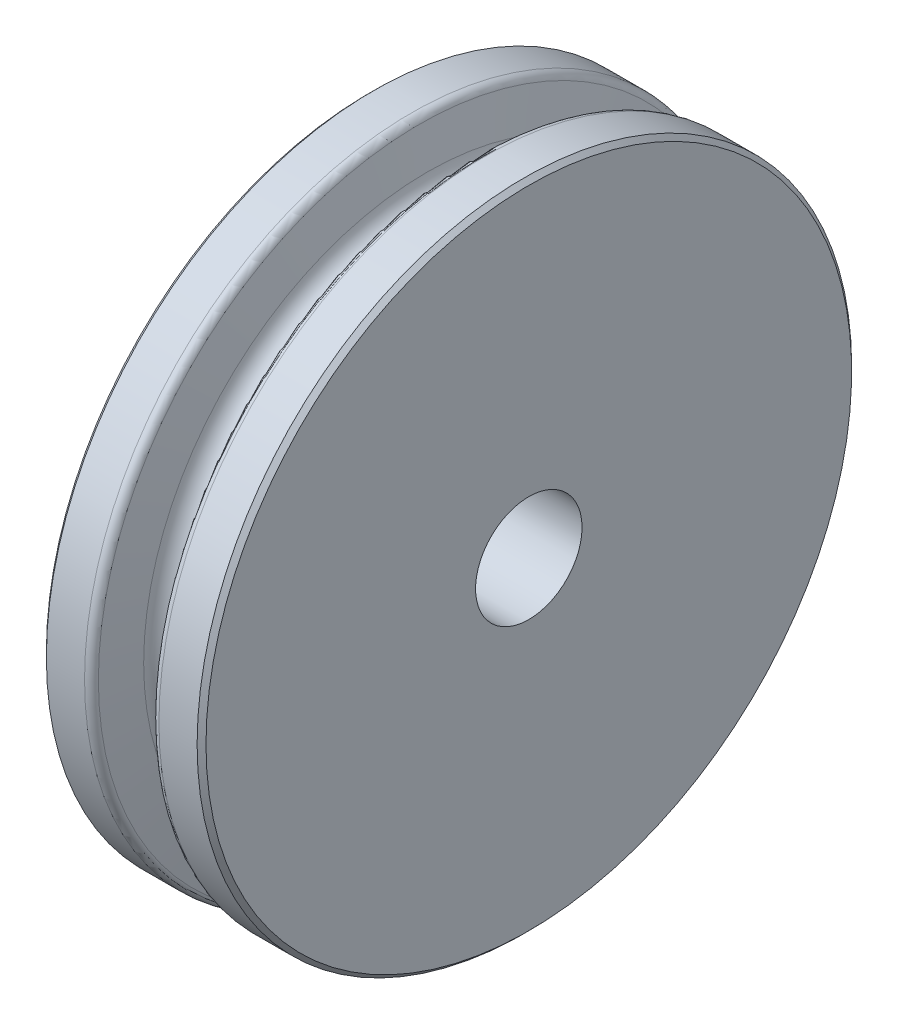
ISO-10303-21;
HEADER;
FILE_DESCRIPTION(('STEP AP214'),'2;1');
FILE_NAME('part.step','',(''),(''),'','','');
FILE_SCHEMA(('AUTOMOTIVE_DESIGN { 1 0 10303 214 1 1 1 1 }'));
ENDSEC;
DATA;
#1=APPLICATION_CONTEXT('core data for automotive mechanical design processes');
#2=APPLICATION_PROTOCOL_DEFINITION('international standard','automotive_design',2000,#1);
#3=PRODUCT_CONTEXT('',#1,'mechanical');
#4=PRODUCT('Part','Part','',(#3));
#5=PRODUCT_RELATED_PRODUCT_CATEGORY('part','',(#4));
#6=PRODUCT_DEFINITION_FORMATION('','',#4);
#7=PRODUCT_DEFINITION_CONTEXT('part definition',#1,'design');
#8=PRODUCT_DEFINITION('design','',#6,#7);
#9=PRODUCT_DEFINITION_SHAPE('','',#8);
#10=(LENGTH_UNIT() NAMED_UNIT(*) SI_UNIT(.MILLI.,.METRE.));
#11=(NAMED_UNIT(*) PLANE_ANGLE_UNIT() SI_UNIT($,.RADIAN.));
#12=(NAMED_UNIT(*) SI_UNIT($,.STERADIAN.) SOLID_ANGLE_UNIT());
#13=UNCERTAINTY_MEASURE_WITH_UNIT(LENGTH_MEASURE(1.E-05),#10,'distance_accuracy_value','');
#14=(GEOMETRIC_REPRESENTATION_CONTEXT(3) GLOBAL_UNCERTAINTY_ASSIGNED_CONTEXT((#13)) GLOBAL_UNIT_ASSIGNED_CONTEXT((#10,
#11,#12)) REPRESENTATION_CONTEXT('',''));
#15=CARTESIAN_POINT('',(0.,0.,0.));
#16=DIRECTION('',(0.,0.,1.));
#17=DIRECTION('',(1.,0.,0.));
#18=AXIS2_PLACEMENT_3D('',#15,#16,#17);
#19=CARTESIAN_POINT('',(-14.2875,0.,0.));
#20=DIRECTION('',(-1.,0.,0.));
#21=DIRECTION('',(0.,0.,1.));
#22=AXIS2_PLACEMENT_3D('',#19,#20,#21);
#23=CYLINDRICAL_SURFACE('',#22,58.5868910256412);
#24=CARTESIAN_POINT('',(-13.49375,0.,0.));
#25=DIRECTION('',(-1.,0.,0.));
#26=DIRECTION('',(0.,0.,1.));
#27=AXIS2_PLACEMENT_3D('',#24,#25,#26);
#28=CIRCLE('',#27,58.5868910256412);
#29=CARTESIAN_POINT('',(-13.49375,0.,58.5868910256412));
#30=VERTEX_POINT('',#29);
#31=EDGE_CURVE('E10',#30,#30,#28,.T.);
#32=ORIENTED_EDGE('',*,*,#31,.F.);
#33=EDGE_LOOP('',(#32));
#34=FACE_BOUND('',#33,.T.);
#35=CARTESIAN_POINT('',(-6.65934461626299,0.,0.));
#36=DIRECTION('',(-1.,0.,0.));
#37=DIRECTION('',(0.,0.,1.));
#38=AXIS2_PLACEMENT_3D('',#35,#36,#37);
#39=CIRCLE('',#38,58.5868910256412);
#40=CARTESIAN_POINT('',(-6.65934461626299,0.,58.5868910256412));
#41=VERTEX_POINT('',#40);
#42=EDGE_CURVE('E437',#41,#41,#39,.T.);
#43=ORIENTED_EDGE('',*,*,#42,.T.);
#44=EDGE_LOOP('',(#43));
#45=FACE_BOUND('',#44,.T.);
#46=ADVANCED_FACE('F403',(#34,#45),#23,.T.);
#47=CARTESIAN_POINT('',(-13.49375,0.,0.));
#48=DIRECTION('',(1.,0.,0.));
#49=DIRECTION('',(0.,0.,-1.));
#50=AXIS2_PLACEMENT_3D('',#47,#48,#49);
#51=CONICAL_SURFACE('',#50,58.5868910256412,0.78539816339745);
#52=CARTESIAN_POINT('',(-14.2875,0.,0.));
#53=DIRECTION('',(-1.,0.,0.));
#54=DIRECTION('',(0.,0.,1.));
#55=AXIS2_PLACEMENT_3D('',#52,#53,#54);
#56=CIRCLE('',#55,57.7931410256412);
#57=CARTESIAN_POINT('',(-14.2875,0.,57.7931410256412));
#58=VERTEX_POINT('',#57);
#59=EDGE_CURVE('E409',#58,#58,#56,.T.);
#60=ORIENTED_EDGE('',*,*,#59,.F.);
#61=EDGE_LOOP('',(#60));
#62=FACE_BOUND('',#61,.T.);
#63=ORIENTED_EDGE('',*,*,#31,.T.);
#64=EDGE_LOOP('',(#63));
#65=FACE_BOUND('',#64,.T.);
#66=ADVANCED_FACE('F470',(#62,#65),#51,.T.);
#67=CARTESIAN_POINT('',(-14.2875,57.7931410256412,0.));
#68=DIRECTION('',(1.,0.,0.));
#69=DIRECTION('',(0.,0.,-1.));
#70=AXIS2_PLACEMENT_3D('',#67,#68,#69);
#71=PLANE('',#70);
#72=CARTESIAN_POINT('',(-14.2875,0.,0.));
#73=DIRECTION('',(1.,0.,0.));
#74=DIRECTION('',(0.,0.,-1.));
#75=AXIS2_PLACEMENT_3D('',#72,#73,#74);
#76=CIRCLE('',#75,9.53135);
#77=CARTESIAN_POINT('',(-14.2875,0.,-9.53135));
#78=VERTEX_POINT('',#77);
#79=EDGE_CURVE('E440',#78,#78,#76,.T.);
#80=ORIENTED_EDGE('',*,*,#79,.T.);
#81=EDGE_LOOP('',(#80));
#82=FACE_BOUND('',#81,.T.);
#83=ORIENTED_EDGE('',*,*,#59,.T.);
#84=EDGE_LOOP('',(#83));
#85=FACE_BOUND('',#84,.T.);
#86=ADVANCED_FACE('F453',(#82,#85),#71,.F.);
#87=CARTESIAN_POINT('',(14.2875,57.7931410256413,0.));
#88=DIRECTION('',(-1.,0.,0.));
#89=DIRECTION('',(0.,0.,1.));
#90=AXIS2_PLACEMENT_3D('',#87,#88,#89);
#91=PLANE('',#90);
#92=CARTESIAN_POINT('',(14.2875,0.,0.));
#93=DIRECTION('',(1.,0.,0.));
#94=DIRECTION('',(0.,0.,-1.));
#95=AXIS2_PLACEMENT_3D('',#92,#93,#94);
#96=CIRCLE('',#95,9.53135);
#97=CARTESIAN_POINT('',(14.2875,0.,-9.53135));
#98=VERTEX_POINT('',#97);
#99=EDGE_CURVE('E443',#98,#98,#96,.T.);
#100=ORIENTED_EDGE('',*,*,#99,.F.);
#101=EDGE_LOOP('',(#100));
#102=FACE_BOUND('',#101,.T.);
#103=CARTESIAN_POINT('',(14.2875,0.,0.));
#104=DIRECTION('',(-1.,0.,0.));
#105=DIRECTION('',(0.,0.,1.));
#106=AXIS2_PLACEMENT_3D('',#103,#104,#105);
#107=CIRCLE('',#106,57.7931410256413);
#108=CARTESIAN_POINT('',(14.2875,0.,57.7931410256413));
#109=VERTEX_POINT('',#108);
#110=EDGE_CURVE('E413',#109,#109,#107,.T.);
#111=ORIENTED_EDGE('',*,*,#110,.F.);
#112=EDGE_LOOP('',(#111));
#113=FACE_BOUND('',#112,.T.);
#114=ADVANCED_FACE('F449',(#102,#113),#91,.F.);
#115=CARTESIAN_POINT('',(14.2875,0.,0.));
#116=DIRECTION('',(-1.,0.,0.));
#117=DIRECTION('',(0.,0.,1.));
#118=AXIS2_PLACEMENT_3D('',#115,#116,#117);
#119=CONICAL_SURFACE('',#118,57.7931410256413,0.785398163397448);
#120=CARTESIAN_POINT('',(13.49375,0.,0.));
#121=DIRECTION('',(-1.,0.,0.));
#122=DIRECTION('',(0.,0.,1.));
#123=AXIS2_PLACEMENT_3D('',#120,#121,#122);
#124=CIRCLE('',#123,58.5868910256413);
#125=CARTESIAN_POINT('',(13.49375,0.,58.5868910256413));
#126=VERTEX_POINT('',#125);
#127=EDGE_CURVE('E417',#126,#126,#124,.T.);
#128=ORIENTED_EDGE('',*,*,#127,.F.);
#129=EDGE_LOOP('',(#128));
#130=FACE_BOUND('',#129,.T.);
#131=ORIENTED_EDGE('',*,*,#110,.T.);
#132=EDGE_LOOP('',(#131));
#133=FACE_BOUND('',#132,.T.);
#134=ADVANCED_FACE('F452',(#130,#133),#119,.T.);
#135=CARTESIAN_POINT('',(-14.2875,0.,0.));
#136=DIRECTION('',(-1.,0.,0.));
#137=DIRECTION('',(0.,0.,1.));
#138=AXIS2_PLACEMENT_3D('',#135,#136,#137);
#139=CYLINDRICAL_SURFACE('',#138,58.5868910256412);
#140=CARTESIAN_POINT('',(6.659344616263,0.,0.));
#141=DIRECTION('',(-1.,0.,0.));
#142=DIRECTION('',(0.,0.,1.));
#143=AXIS2_PLACEMENT_3D('',#140,#141,#142);
#144=CIRCLE('',#143,58.5868910256412);
#145=CARTESIAN_POINT('',(6.659344616263,0.,58.5868910256412));
#146=VERTEX_POINT('',#145);
#147=EDGE_CURVE('E422',#146,#146,#144,.T.);
#148=ORIENTED_EDGE('',*,*,#147,.F.);
#149=EDGE_LOOP('',(#148));
#150=FACE_BOUND('',#149,.T.);
#151=ORIENTED_EDGE('',*,*,#127,.T.);
#152=EDGE_LOOP('',(#151));
#153=FACE_BOUND('',#152,.T.);
#154=ADVANCED_FACE('F458',(#150,#153),#139,.T.);
#155=CARTESIAN_POINT('',(6.659344616263,0.,0.));
#156=DIRECTION('',(-1.,0.,0.));
#157=DIRECTION('',(0.,0.,1.));
#158=AXIS2_PLACEMENT_3D('',#155,#156,#157);
#159=TOROIDAL_SURFACE('',#158,57.1889805650749,1.39791046056634);
#160=CARTESIAN_POINT('',(5.2913004385583,0.,0.));
#161=DIRECTION('',(-1.,0.,0.));
#162=DIRECTION('',(0.,0.,1.));
#163=AXIS2_PLACEMENT_3D('',#160,#161,#162);
#164=CIRCLE('',#163,57.476398002975);
#165=CARTESIAN_POINT('',(5.2913004385583,0.,57.476398002975));
#166=VERTEX_POINT('',#165);
#167=EDGE_CURVE('E425',#166,#166,#164,.T.);
#168=ORIENTED_EDGE('',*,*,#167,.F.);
#169=EDGE_LOOP('',(#168));
#170=FACE_BOUND('',#169,.T.);
#171=ORIENTED_EDGE('',*,*,#147,.T.);
#172=EDGE_LOOP('',(#171));
#173=FACE_BOUND('',#172,.T.);
#174=ADVANCED_FACE('F465',(#170,#173),#159,.T.);
#175=CARTESIAN_POINT('',(5.2913004385583,0.,0.));
#176=DIRECTION('',(1.,0.,0.));
#177=DIRECTION('',(0.,0.,-1.));
#178=AXIS2_PLACEMENT_3D('',#175,#176,#177);
#179=CONICAL_SURFACE('',#178,57.476398002975,1.36371440951659);
#180=CARTESIAN_POINT('',(3.88395786670477,0.,0.));
#181=DIRECTION('',(-1.,0.,0.));
#182=DIRECTION('',(0.,0.,1.));
#183=AXIS2_PLACEMENT_3D('',#180,#181,#182);
#184=CIRCLE('',#183,50.7777549925632);
#185=CARTESIAN_POINT('',(3.88395786670477,0.,50.7777549925632));
#186=VERTEX_POINT('',#185);
#187=EDGE_CURVE('E428',#186,#186,#184,.T.);
#188=ORIENTED_EDGE('',*,*,#187,.F.);
#189=EDGE_LOOP('',(#188));
#190=FACE_BOUND('',#189,.T.);
#191=ORIENTED_EDGE('',*,*,#167,.T.);
#192=EDGE_LOOP('',(#191));
#193=FACE_BOUND('',#192,.T.);
#194=ADVANCED_FACE('F493',(#190,#193),#179,.T.);
#195=CARTESIAN_POINT('',(0.,0.,0.));
#196=DIRECTION('',(-1.,0.,0.));
#197=DIRECTION('',(0.,0.,1.));
#198=AXIS2_PLACEMENT_3D('',#195,#196,#197);
#199=TOROIDAL_SURFACE('',#198,51.5937500000002,3.96875);
#200=CARTESIAN_POINT('',(-3.88395786670477,0.,0.));
#201=DIRECTION('',(-1.,0.,0.));
#202=DIRECTION('',(0.,0.,1.));
#203=AXIS2_PLACEMENT_3D('',#200,#201,#202);
#204=CIRCLE('',#203,50.7777549925632);
#205=CARTESIAN_POINT('',(-3.88395786670477,0.,50.7777549925632));
#206=VERTEX_POINT('',#205);
#207=EDGE_CURVE('E431',#206,#206,#204,.T.);
#208=ORIENTED_EDGE('',*,*,#207,.F.);
#209=EDGE_LOOP('',(#208));
#210=FACE_BOUND('',#209,.T.);
#211=ORIENTED_EDGE('',*,*,#187,.T.);
#212=EDGE_LOOP('',(#211));
#213=FACE_BOUND('',#212,.T.);
#214=ADVANCED_FACE('F487',(#210,#213),#199,.F.);
#215=CARTESIAN_POINT('',(-3.88395786670477,0.,0.));
#216=DIRECTION('',(-1.,0.,0.));
#217=DIRECTION('',(0.,0.,1.));
#218=AXIS2_PLACEMENT_3D('',#215,#216,#217);
#219=CONICAL_SURFACE('',#218,50.7777549925632,1.36371440951659);
#220=CARTESIAN_POINT('',(-5.2913004385583,0.,0.));
#221=DIRECTION('',(-1.,0.,0.));
#222=DIRECTION('',(0.,0.,1.));
#223=AXIS2_PLACEMENT_3D('',#220,#221,#222);
#224=CIRCLE('',#223,57.476398002975);
#225=CARTESIAN_POINT('',(-5.2913004385583,0.,57.476398002975));
#226=VERTEX_POINT('',#225);
#227=EDGE_CURVE('E434',#226,#226,#224,.T.);
#228=ORIENTED_EDGE('',*,*,#227,.F.);
#229=EDGE_LOOP('',(#228));
#230=FACE_BOUND('',#229,.T.);
#231=ORIENTED_EDGE('',*,*,#207,.T.);
#232=EDGE_LOOP('',(#231));
#233=FACE_BOUND('',#232,.T.);
#234=ADVANCED_FACE('F481',(#230,#233),#219,.T.);
#235=CARTESIAN_POINT('',(-6.65934461626299,0.,0.));
#236=DIRECTION('',(-1.,0.,0.));
#237=DIRECTION('',(0.,0.,1.));
#238=AXIS2_PLACEMENT_3D('',#235,#236,#237);
#239=TOROIDAL_SURFACE('',#238,57.1889805650749,1.39791046056632);
#240=ORIENTED_EDGE('',*,*,#42,.F.);
#241=EDGE_LOOP('',(#240));
#242=FACE_BOUND('',#241,.T.);
#243=ORIENTED_EDGE('',*,*,#227,.T.);
#244=EDGE_LOOP('',(#243));
#245=FACE_BOUND('',#244,.T.);
#246=ADVANCED_FACE('F478',(#242,#245),#239,.T.);
#247=CARTESIAN_POINT('',(-14.2875,0.,0.));
#248=DIRECTION('',(1.,0.,0.));
#249=DIRECTION('',(0.,0.,-1.));
#250=AXIS2_PLACEMENT_3D('',#247,#248,#249);
#251=CYLINDRICAL_SURFACE('',#250,9.53135);
#252=ORIENTED_EDGE('',*,*,#79,.F.);
#253=EDGE_LOOP('',(#252));
#254=FACE_BOUND('',#253,.T.);
#255=ORIENTED_EDGE('',*,*,#99,.T.);
#256=EDGE_LOOP('',(#255));
#257=FACE_BOUND('',#256,.T.);
#258=ADVANCED_FACE('F447',(#254,#257),#251,.F.);
#259=CLOSED_SHELL('',(#46,#66,#86,#114,#134,#154,#174,#194,#214,#234,#246,#258));
#260=MANIFOLD_SOLID_BREP('B2',#259);
#261=ADVANCED_BREP_SHAPE_REPRESENTATION('',(#18,#260),#14);
#262=SHAPE_DEFINITION_REPRESENTATION(#9,#261);
ENDSEC;
END-ISO-10303-21;
